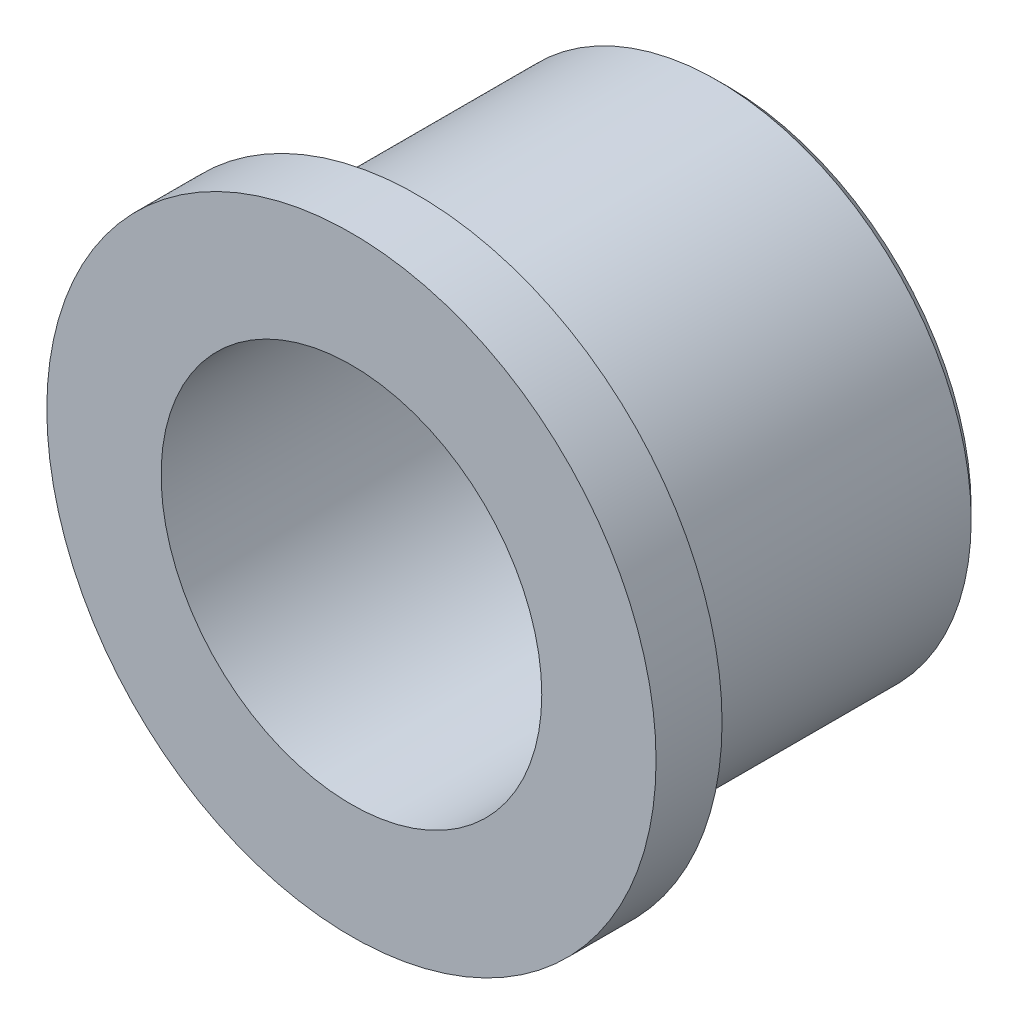
ISO-10303-21;
HEADER;
FILE_DESCRIPTION(('STEP AP214'),'2;1');
FILE_NAME('part.step','',(''),(''),'','','');
FILE_SCHEMA(('AUTOMOTIVE_DESIGN { 1 0 10303 214 1 1 1 1 }'));
ENDSEC;
DATA;
#1=APPLICATION_CONTEXT('core data for automotive mechanical design processes');
#2=APPLICATION_PROTOCOL_DEFINITION('international standard','automotive_design',2000,#1);
#3=PRODUCT_CONTEXT('',#1,'mechanical');
#4=PRODUCT('Part','Part','',(#3));
#5=PRODUCT_RELATED_PRODUCT_CATEGORY('part','',(#4));
#6=PRODUCT_DEFINITION_FORMATION('','',#4);
#7=PRODUCT_DEFINITION_CONTEXT('part definition',#1,'design');
#8=PRODUCT_DEFINITION('design','',#6,#7);
#9=PRODUCT_DEFINITION_SHAPE('','',#8);
#10=(LENGTH_UNIT() NAMED_UNIT(*) SI_UNIT(.MILLI.,.METRE.));
#11=(NAMED_UNIT(*) PLANE_ANGLE_UNIT() SI_UNIT($,.RADIAN.));
#12=(NAMED_UNIT(*) SI_UNIT($,.STERADIAN.) SOLID_ANGLE_UNIT());
#13=UNCERTAINTY_MEASURE_WITH_UNIT(LENGTH_MEASURE(1.E-05),#10,'distance_accuracy_value','');
#14=(GEOMETRIC_REPRESENTATION_CONTEXT(3) GLOBAL_UNCERTAINTY_ASSIGNED_CONTEXT((#13)) GLOBAL_UNIT_ASSIGNED_CONTEXT((#10,
#11,#12)) REPRESENTATION_CONTEXT('',''));
#15=CARTESIAN_POINT('',(0.,0.,0.));
#16=DIRECTION('',(0.,0.,1.));
#17=DIRECTION('',(1.,0.,0.));
#18=AXIS2_PLACEMENT_3D('',#15,#16,#17);
#19=CARTESIAN_POINT('',(0.,12.7,0.));
#20=DIRECTION('',(0.,0.,1.));
#21=DIRECTION('',(1.,0.,0.));
#22=AXIS2_PLACEMENT_3D('',#19,#20,#21);
#23=PLANE('',#22);
#24=CARTESIAN_POINT('',(0.,0.,0.));
#25=DIRECTION('',(0.,0.,1.));
#26=DIRECTION('',(1.,0.,0.));
#27=AXIS2_PLACEMENT_3D('',#24,#25,#26);
#28=CIRCLE('',#27,12.192);
#29=CARTESIAN_POINT('',(12.192,0.,0.));
#30=VERTEX_POINT('',#29);
#31=EDGE_CURVE('E10',#30,#30,#28,.F.);
#32=ORIENTED_EDGE('',*,*,#31,.T.);
#33=EDGE_LOOP('',(#32));
#34=FACE_BOUND('',#33,.T.);
#35=CARTESIAN_POINT('',(0.,0.,0.));
#36=DIRECTION('',(0.,0.,1.));
#37=DIRECTION('',(1.,0.,0.));
#38=AXIS2_PLACEMENT_3D('',#35,#36,#37);
#39=CIRCLE('',#38,9.52499999999999);
#40=CARTESIAN_POINT('',(9.52499999999999,0.,0.));
#41=VERTEX_POINT('',#40);
#42=EDGE_CURVE('E61',#41,#41,#39,.T.);
#43=ORIENTED_EDGE('',*,*,#42,.T.);
#44=EDGE_LOOP('',(#43));
#45=FACE_BOUND('',#44,.T.);
#46=ADVANCED_FACE('F37',(#34,#45),#23,.F.);
#47=CARTESIAN_POINT('',(0.,0.,18.8214000000001));
#48=DIRECTION('',(0.,0.,-1.));
#49=DIRECTION('',(-1.,0.,0.));
#50=AXIS2_PLACEMENT_3D('',#47,#48,#49);
#51=PLANE('',#50);
#52=CARTESIAN_POINT('',(0.,0.,18.8214000000001));
#53=DIRECTION('',(0.,0.,1.));
#54=DIRECTION('',(1.,0.,0.));
#55=AXIS2_PLACEMENT_3D('',#52,#53,#54);
#56=CIRCLE('',#55,9.525);
#57=CARTESIAN_POINT('',(9.525,0.,18.8214000000001));
#58=VERTEX_POINT('',#57);
#59=EDGE_CURVE('E64',#58,#58,#56,.T.);
#60=ORIENTED_EDGE('',*,*,#59,.F.);
#61=EDGE_LOOP('',(#60));
#62=FACE_BOUND('',#61,.T.);
#63=CARTESIAN_POINT('',(0.,0.,18.8214000000001));
#64=DIRECTION('',(0.,0.,1.));
#65=DIRECTION('',(1.,0.,0.));
#66=AXIS2_PLACEMENT_3D('',#63,#64,#65);
#67=CIRCLE('',#66,15.2442333333334);
#68=CARTESIAN_POINT('',(15.2442333333334,0.,18.8214000000001));
#69=VERTEX_POINT('',#68);
#70=EDGE_CURVE('E49',#69,#69,#67,.T.);
#71=ORIENTED_EDGE('',*,*,#70,.T.);
#72=EDGE_LOOP('',(#71));
#73=FACE_BOUND('',#72,.T.);
#74=ADVANCED_FACE('F70',(#62,#73),#51,.F.);
#75=CARTESIAN_POINT('',(0.,0.,0.));
#76=DIRECTION('',(0.,0.,1.));
#77=DIRECTION('',(1.,0.,0.));
#78=AXIS2_PLACEMENT_3D('',#75,#76,#77);
#79=CYLINDRICAL_SURFACE('',#78,15.2442333333334);
#80=ORIENTED_EDGE('',*,*,#70,.F.);
#81=EDGE_LOOP('',(#80));
#82=FACE_BOUND('',#81,.T.);
#83=CARTESIAN_POINT('',(0.,0.,15.5194));
#84=DIRECTION('',(0.,0.,1.));
#85=DIRECTION('',(1.,0.,0.));
#86=AXIS2_PLACEMENT_3D('',#83,#84,#85);
#87=CIRCLE('',#86,15.2442333333334);
#88=CARTESIAN_POINT('',(15.2442333333334,0.,15.5194));
#89=VERTEX_POINT('',#88);
#90=EDGE_CURVE('E53',#89,#89,#87,.T.);
#91=ORIENTED_EDGE('',*,*,#90,.T.);
#92=EDGE_LOOP('',(#91));
#93=FACE_BOUND('',#92,.T.);
#94=ADVANCED_FACE('F73',(#82,#93),#79,.T.);
#95=CARTESIAN_POINT('',(0.,15.2442333333334,15.5194000000001));
#96=DIRECTION('',(0.,0.,1.));
#97=DIRECTION('',(1.,0.,0.));
#98=AXIS2_PLACEMENT_3D('',#95,#96,#97);
#99=PLANE('',#98);
#100=ORIENTED_EDGE('',*,*,#90,.F.);
#101=EDGE_LOOP('',(#100));
#102=FACE_BOUND('',#101,.T.);
#103=CARTESIAN_POINT('',(0.,0.,15.5194000000001));
#104=DIRECTION('',(0.,0.,1.));
#105=DIRECTION('',(1.,0.,0.));
#106=AXIS2_PLACEMENT_3D('',#103,#104,#105);
#107=CIRCLE('',#106,12.7);
#108=CARTESIAN_POINT('',(12.7,0.,15.5194000000001));
#109=VERTEX_POINT('',#108);
#110=EDGE_CURVE('E58',#109,#109,#107,.T.);
#111=ORIENTED_EDGE('',*,*,#110,.T.);
#112=EDGE_LOOP('',(#111));
#113=FACE_BOUND('',#112,.T.);
#114=ADVANCED_FACE('F79',(#102,#113),#99,.F.);
#115=CARTESIAN_POINT('',(0.,0.,0.));
#116=DIRECTION('',(0.,0.,1.));
#117=DIRECTION('',(1.,0.,0.));
#118=AXIS2_PLACEMENT_3D('',#115,#116,#117);
#119=CYLINDRICAL_SURFACE('',#118,12.7);
#120=CARTESIAN_POINT('',(0.,0.,0.508));
#121=DIRECTION('',(0.,0.,1.));
#122=DIRECTION('',(1.,0.,0.));
#123=AXIS2_PLACEMENT_3D('',#120,#121,#122);
#124=CIRCLE('',#123,12.7);
#125=CARTESIAN_POINT('',(12.7,0.,0.508));
#126=VERTEX_POINT('',#125);
#127=EDGE_CURVE('E45',#126,#126,#124,.T.);
#128=ORIENTED_EDGE('',*,*,#127,.T.);
#129=EDGE_LOOP('',(#128));
#130=FACE_BOUND('',#129,.T.);
#131=ORIENTED_EDGE('',*,*,#110,.F.);
#132=EDGE_LOOP('',(#131));
#133=FACE_BOUND('',#132,.T.);
#134=ADVANCED_FACE('F85',(#130,#133),#119,.T.);
#135=CARTESIAN_POINT('',(0.,0.,18.8214000000001));
#136=DIRECTION('',(0.,0.,1.));
#137=DIRECTION('',(1.,0.,0.));
#138=AXIS2_PLACEMENT_3D('',#135,#136,#137);
#139=CYLINDRICAL_SURFACE('',#138,9.525);
#140=ORIENTED_EDGE('',*,*,#42,.F.);
#141=EDGE_LOOP('',(#140));
#142=FACE_BOUND('',#141,.T.);
#143=ORIENTED_EDGE('',*,*,#59,.T.);
#144=EDGE_LOOP('',(#143));
#145=FACE_BOUND('',#144,.T.);
#146=ADVANCED_FACE('F68',(#142,#145),#139,.F.);
#147=CARTESIAN_POINT('',(0.,0.,0.508));
#148=DIRECTION('',(0.,0.,1.));
#149=DIRECTION('',(1.,0.,0.));
#150=AXIS2_PLACEMENT_3D('',#147,#148,#149);
#151=CONICAL_SURFACE('',#150,12.7,0.785398163397447);
#152=ORIENTED_EDGE('',*,*,#31,.F.);
#153=EDGE_LOOP('',(#152));
#154=FACE_BOUND('',#153,.T.);
#155=ORIENTED_EDGE('',*,*,#127,.F.);
#156=EDGE_LOOP('',(#155));
#157=FACE_BOUND('',#156,.T.);
#158=ADVANCED_FACE('F40',(#154,#157),#151,.T.);
#159=CLOSED_SHELL('',(#46,#74,#94,#114,#134,#146,#158));
#160=MANIFOLD_SOLID_BREP('B2',#159);
#161=ADVANCED_BREP_SHAPE_REPRESENTATION('',(#18,#160),#14);
#162=SHAPE_DEFINITION_REPRESENTATION(#9,#161);
ENDSEC;
END-ISO-10303-21;
